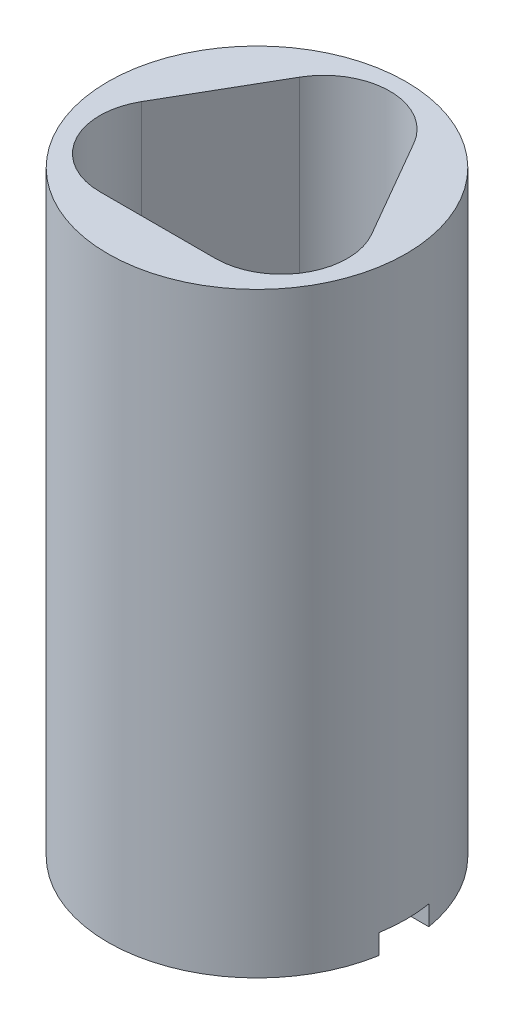
ISO-10303-21;
HEADER;
FILE_DESCRIPTION(('STEP AP214'),'2;1');
FILE_NAME('part.step','',(''),(''),'','','');
FILE_SCHEMA(('AUTOMOTIVE_DESIGN { 1 0 10303 214 1 1 1 1 }'));
ENDSEC;
DATA;
#1=APPLICATION_CONTEXT('core data for automotive mechanical design processes');
#2=APPLICATION_PROTOCOL_DEFINITION('international standard','automotive_design',2000,#1);
#3=PRODUCT_CONTEXT('',#1,'mechanical');
#4=PRODUCT('Part','Part','',(#3));
#5=PRODUCT_RELATED_PRODUCT_CATEGORY('part','',(#4));
#6=PRODUCT_DEFINITION_FORMATION('','',#4);
#7=PRODUCT_DEFINITION_CONTEXT('part definition',#1,'design');
#8=PRODUCT_DEFINITION('design','',#6,#7);
#9=PRODUCT_DEFINITION_SHAPE('','',#8);
#10=(LENGTH_UNIT() NAMED_UNIT(*) SI_UNIT(.MILLI.,.METRE.));
#11=(NAMED_UNIT(*) PLANE_ANGLE_UNIT() SI_UNIT($,.RADIAN.));
#12=(NAMED_UNIT(*) SI_UNIT($,.STERADIAN.) SOLID_ANGLE_UNIT());
#13=UNCERTAINTY_MEASURE_WITH_UNIT(LENGTH_MEASURE(1.E-05),#10,'distance_accuracy_value','');
#14=(GEOMETRIC_REPRESENTATION_CONTEXT(3) GLOBAL_UNCERTAINTY_ASSIGNED_CONTEXT((#13)) GLOBAL_UNIT_ASSIGNED_CONTEXT((#10,
#11,#12)) REPRESENTATION_CONTEXT('',''));
#15=CARTESIAN_POINT('',(0.,0.,0.));
#16=DIRECTION('',(0.,0.,1.));
#17=DIRECTION('',(1.,0.,0.));
#18=AXIS2_PLACEMENT_3D('',#15,#16,#17);
#19=CARTESIAN_POINT('',(0.,0.,0.));
#20=DIRECTION('',(0.,1.,0.));
#21=DIRECTION('',(0.,0.,1.));
#22=AXIS2_PLACEMENT_3D('',#19,#20,#21);
#23=PLANE('',#22);
#24=CARTESIAN_POINT('',(0.,0.,0.));
#25=DIRECTION('',(0.,1.,0.));
#26=DIRECTION('',(0.,0.,1.));
#27=AXIS2_PLACEMENT_3D('',#24,#25,#26);
#28=CIRCLE('',#27,4.7625);
#29=CARTESIAN_POINT('',(-4.69588832783532,0.,0.79375));
#30=VERTEX_POINT('',#29);
#31=CARTESIAN_POINT('',(4.69588832783532,0.,0.79375));
#32=VERTEX_POINT('',#31);
#33=EDGE_CURVE('E249',#30,#32,#28,.T.);
#34=ORIENTED_EDGE('',*,*,#33,.F.);
#35=DIRECTION('',(-1.,0.,0.));
#36=VECTOR('',#35,1.);
#37=CARTESIAN_POINT('',(4.7625,0.,0.79375));
#38=LINE('',#37,#36);
#39=CARTESIAN_POINT('',(-3.40110528909353,0.,0.79375));
#40=VERTEX_POINT('',#39);
#41=EDGE_CURVE('E150',#40,#30,#38,.T.);
#42=ORIENTED_EDGE('',*,*,#41,.F.);
#43=CARTESIAN_POINT('',(0.,0.,0.));
#44=DIRECTION('',(0.,-1.,0.));
#45=DIRECTION('',(0.,0.,-1.));
#46=AXIS2_PLACEMENT_3D('',#43,#44,#45);
#47=CIRCLE('',#46,3.4925);
#48=CARTESIAN_POINT('',(3.40110528909353,0.,0.79375));
#49=VERTEX_POINT('',#48);
#50=EDGE_CURVE('E243',#49,#40,#47,.T.);
#51=ORIENTED_EDGE('',*,*,#50,.F.);
#52=EDGE_CURVE('E306',#32,#49,#38,.T.);
#53=ORIENTED_EDGE('',*,*,#52,.F.);
#54=EDGE_LOOP('',(#34,#42,#51,#53));
#55=FACE_BOUND('',#54,.T.);
#56=ADVANCED_FACE('F41',(#55),#23,.F.);
#57=CARTESIAN_POINT('',(0.,0.635,0.));
#58=DIRECTION('',(0.,-1.,0.));
#59=DIRECTION('',(0.,0.,-1.));
#60=AXIS2_PLACEMENT_3D('',#57,#58,#59);
#61=CYLINDRICAL_SURFACE('',#60,3.4925);
#62=ORIENTED_EDGE('',*,*,#50,.T.);
#63=DIRECTION('',(0.,-1.,0.));
#64=VECTOR('',#63,1.);
#65=CARTESIAN_POINT('',(-3.40110528909353,0.635,0.79375));
#66=LINE('',#65,#64);
#67=CARTESIAN_POINT('',(-3.40110528909353,0.635,0.79375));
#68=VERTEX_POINT('',#67);
#69=EDGE_CURVE('E186',#40,#68,#66,.F.);
#70=ORIENTED_EDGE('',*,*,#69,.T.);
#71=CARTESIAN_POINT('',(0.,0.635,0.));
#72=DIRECTION('',(0.,-1.,0.));
#73=DIRECTION('',(0.,0.,-1.));
#74=AXIS2_PLACEMENT_3D('',#71,#72,#73);
#75=CIRCLE('',#74,3.4925);
#76=CARTESIAN_POINT('',(3.40110528909353,0.635,0.79375));
#77=VERTEX_POINT('',#76);
#78=EDGE_CURVE('E161',#77,#68,#75,.T.);
#79=ORIENTED_EDGE('',*,*,#78,.F.);
#80=DIRECTION('',(0.,-1.,0.));
#81=VECTOR('',#80,1.);
#82=CARTESIAN_POINT('',(3.40110528909353,0.635,0.79375));
#83=LINE('',#82,#81);
#84=EDGE_CURVE('E183',#77,#49,#83,.T.);
#85=ORIENTED_EDGE('',*,*,#84,.T.);
#86=EDGE_LOOP('',(#62,#70,#79,#85));
#87=FACE_BOUND('',#86,.T.);
#88=ADVANCED_FACE('F275',(#87),#61,.F.);
#89=CARTESIAN_POINT('',(0.,19.05,0.));
#90=DIRECTION('',(0.,-1.,0.));
#91=DIRECTION('',(0.,0.,-1.));
#92=AXIS2_PLACEMENT_3D('',#89,#90,#91);
#93=CYLINDRICAL_SURFACE('',#92,4.7625);
#94=ORIENTED_EDGE('',*,*,#33,.T.);
#95=DIRECTION('',(0.,-1.,0.));
#96=VECTOR('',#95,1.);
#97=CARTESIAN_POINT('',(4.69588832783532,19.05,0.79375));
#98=LINE('',#97,#96);
#99=CARTESIAN_POINT('',(4.69588832783532,0.635,0.79375));
#100=VERTEX_POINT('',#99);
#101=EDGE_CURVE('E156',#32,#100,#98,.F.);
#102=ORIENTED_EDGE('',*,*,#101,.T.);
#103=CARTESIAN_POINT('',(0.,0.635,0.));
#104=DIRECTION('',(0.,-1.,0.));
#105=DIRECTION('',(0.,0.,-1.));
#106=AXIS2_PLACEMENT_3D('',#103,#104,#105);
#107=CIRCLE('',#106,4.7625);
#108=CARTESIAN_POINT('',(4.69588832783532,0.635,-0.79375));
#109=VERTEX_POINT('',#108);
#110=EDGE_CURVE('E167',#109,#100,#107,.T.);
#111=ORIENTED_EDGE('',*,*,#110,.F.);
#112=DIRECTION('',(0.,-1.,0.));
#113=VECTOR('',#112,1.);
#114=CARTESIAN_POINT('',(4.69588832783532,19.05,-0.79375));
#115=LINE('',#114,#113);
#116=CARTESIAN_POINT('',(4.69588832783532,0.,-0.79375));
#117=VERTEX_POINT('',#116);
#118=EDGE_CURVE('E180',#109,#117,#115,.T.);
#119=ORIENTED_EDGE('',*,*,#118,.T.);
#120=CARTESIAN_POINT('',(-4.69588832783532,0.,-0.79375));
#121=VERTEX_POINT('',#120);
#122=EDGE_CURVE('E50',#117,#121,#28,.T.);
#123=ORIENTED_EDGE('',*,*,#122,.T.);
#124=DIRECTION('',(0.,-1.,0.));
#125=VECTOR('',#124,1.);
#126=CARTESIAN_POINT('',(-4.69588832783532,19.05,-0.79375));
#127=LINE('',#126,#125);
#128=CARTESIAN_POINT('',(-4.69588832783532,0.635,-0.79375));
#129=VERTEX_POINT('',#128);
#130=EDGE_CURVE('E166',#121,#129,#127,.F.);
#131=ORIENTED_EDGE('',*,*,#130,.T.);
#132=CARTESIAN_POINT('',(-4.69588832783532,0.635,0.79375));
#133=VERTEX_POINT('',#132);
#134=EDGE_CURVE('E159',#133,#129,#107,.T.);
#135=ORIENTED_EDGE('',*,*,#134,.F.);
#136=DIRECTION('',(0.,-1.,0.));
#137=VECTOR('',#136,1.);
#138=CARTESIAN_POINT('',(-4.69588832783532,19.05,0.79375));
#139=LINE('',#138,#137);
#140=EDGE_CURVE('E144',#133,#30,#139,.T.);
#141=ORIENTED_EDGE('',*,*,#140,.T.);
#142=EDGE_LOOP('',(#94,#102,#111,#119,#123,#131,#135,#141));
#143=FACE_BOUND('',#142,.T.);
#144=CARTESIAN_POINT('',(0.,19.05,0.));
#145=DIRECTION('',(0.,1.,0.));
#146=DIRECTION('',(0.,0.,1.));
#147=AXIS2_PLACEMENT_3D('',#144,#145,#146);
#148=CIRCLE('',#147,4.7625);
#149=CARTESIAN_POINT('',(0.,19.05,4.7625));
#150=VERTEX_POINT('',#149);
#151=EDGE_CURVE('E11',#150,#150,#148,.T.);
#152=ORIENTED_EDGE('',*,*,#151,.F.);
#153=EDGE_LOOP('',(#152));
#154=FACE_BOUND('',#153,.T.);
#155=ADVANCED_FACE('F43',(#143,#154),#93,.T.);
#156=CARTESIAN_POINT('',(0.,19.05,0.));
#157=DIRECTION('',(0.,1.,0.));
#158=DIRECTION('',(0.,0.,1.));
#159=AXIS2_PLACEMENT_3D('',#156,#157,#158);
#160=PLANE('',#159);
#161=CARTESIAN_POINT('',(1.84775180151448,19.05,1.0668));
#162=DIRECTION('',(0.,1.,0.));
#163=DIRECTION('',(0.,0.,1.));
#164=AXIS2_PLACEMENT_3D('',#161,#162,#163);
#165=CIRCLE('',#164,2.1082);
#166=CARTESIAN_POINT('',(1.84775180151445,19.05,3.175));
#167=VERTEX_POINT('',#166);
#168=CARTESIAN_POINT('',(3.67350655777282,19.05,0.0126999999999734));
#169=VERTEX_POINT('',#168);
#170=EDGE_CURVE('E212',#167,#169,#165,.T.);
#171=ORIENTED_EDGE('',*,*,#170,.F.);
#172=DIRECTION('',(1.,0.,0.));
#173=VECTOR('',#172,1.);
#174=CARTESIAN_POINT('',(-1.84775180151445,19.05,3.175));
#175=LINE('',#174,#173);
#176=CARTESIAN_POINT('',(-1.84775180151445,19.05,3.175));
#177=VERTEX_POINT('',#176);
#178=EDGE_CURVE('E196',#177,#167,#175,.T.);
#179=ORIENTED_EDGE('',*,*,#178,.F.);
#180=CARTESIAN_POINT('',(-1.84775180151448,19.05,1.0668));
#181=DIRECTION('',(0.,1.,0.));
#182=DIRECTION('',(0.,0.,1.));
#183=AXIS2_PLACEMENT_3D('',#180,#181,#182);
#184=CIRCLE('',#183,2.1082);
#185=CARTESIAN_POINT('',(-3.67350655777282,19.05,0.0126999999999755));
#186=VERTEX_POINT('',#185);
#187=EDGE_CURVE('E223',#186,#177,#184,.T.);
#188=ORIENTED_EDGE('',*,*,#187,.F.);
#189=DIRECTION('',(-0.5,0.,0.866025403784439));
#190=VECTOR('',#189,1.);
#191=CARTESIAN_POINT('',(-1.82575475625837,19.05,-3.18769999999997));
#192=LINE('',#191,#190);
#193=CARTESIAN_POINT('',(-1.82575475625837,19.05,-3.18769999999997));
#194=VERTEX_POINT('',#193);
#195=EDGE_CURVE('E220',#194,#186,#192,.T.);
#196=ORIENTED_EDGE('',*,*,#195,.F.);
#197=CARTESIAN_POINT('',(0.,19.05,-2.1336));
#198=DIRECTION('',(0.,1.,0.));
#199=DIRECTION('',(0.,0.,-1.));
#200=AXIS2_PLACEMENT_3D('',#197,#198,#199);
#201=CIRCLE('',#200,2.1082);
#202=CARTESIAN_POINT('',(1.82575475625837,19.05,-3.18769999999997));
#203=VERTEX_POINT('',#202);
#204=EDGE_CURVE('E217',#203,#194,#201,.T.);
#205=ORIENTED_EDGE('',*,*,#204,.F.);
#206=DIRECTION('',(-0.5,0.,-0.866025403784438));
#207=VECTOR('',#206,1.);
#208=CARTESIAN_POINT('',(3.67350655777282,19.05,0.0126999999999736));
#209=LINE('',#208,#207);
#210=EDGE_CURVE('E214',#169,#203,#209,.T.);
#211=ORIENTED_EDGE('',*,*,#210,.F.);
#212=EDGE_LOOP('',(#171,#179,#188,#196,#205,#211));
#213=FACE_BOUND('',#212,.T.);
#214=ORIENTED_EDGE('',*,*,#151,.T.);
#215=EDGE_LOOP('',(#214));
#216=FACE_BOUND('',#215,.T.);
#217=ADVANCED_FACE('F285',(#213,#216),#160,.T.);
#218=ORIENTED_EDGE('',*,*,#122,.F.);
#219=DIRECTION('',(1.,0.,0.));
#220=VECTOR('',#219,1.);
#221=CARTESIAN_POINT('',(4.7625,0.,-0.79375));
#222=LINE('',#221,#220);
#223=CARTESIAN_POINT('',(3.40110528909353,0.,-0.79375));
#224=VERTEX_POINT('',#223);
#225=EDGE_CURVE('E297',#224,#117,#222,.T.);
#226=ORIENTED_EDGE('',*,*,#225,.F.);
#227=CARTESIAN_POINT('',(-3.40110528909353,0.,-0.79375));
#228=VERTEX_POINT('',#227);
#229=EDGE_CURVE('E244',#228,#224,#47,.T.);
#230=ORIENTED_EDGE('',*,*,#229,.F.);
#231=EDGE_CURVE('E298',#121,#228,#222,.T.);
#232=ORIENTED_EDGE('',*,*,#231,.F.);
#233=EDGE_LOOP('',(#218,#226,#230,#232));
#234=FACE_BOUND('',#233,.T.);
#235=ADVANCED_FACE('F277',(#234),#23,.F.);
#236=ORIENTED_EDGE('',*,*,#229,.T.);
#237=DIRECTION('',(0.,-1.,0.));
#238=VECTOR('',#237,1.);
#239=CARTESIAN_POINT('',(3.40110528909353,0.635,-0.79375));
#240=LINE('',#239,#238);
#241=CARTESIAN_POINT('',(3.40110528909353,0.635,-0.79375));
#242=VERTEX_POINT('',#241);
#243=EDGE_CURVE('E176',#224,#242,#240,.F.);
#244=ORIENTED_EDGE('',*,*,#243,.T.);
#245=CARTESIAN_POINT('',(-3.40110528909353,0.635,-0.79375));
#246=VERTEX_POINT('',#245);
#247=EDGE_CURVE('E241',#246,#242,#75,.T.);
#248=ORIENTED_EDGE('',*,*,#247,.F.);
#249=DIRECTION('',(0.,-1.,0.));
#250=VECTOR('',#249,1.);
#251=CARTESIAN_POINT('',(-3.40110528909353,0.635,-0.79375));
#252=LINE('',#251,#250);
#253=EDGE_CURVE('E170',#246,#228,#252,.T.);
#254=ORIENTED_EDGE('',*,*,#253,.T.);
#255=EDGE_LOOP('',(#236,#244,#248,#254));
#256=FACE_BOUND('',#255,.T.);
#257=ADVANCED_FACE('F283',(#256),#61,.F.);
#258=CARTESIAN_POINT('',(0.,0.635,0.));
#259=DIRECTION('',(0.,-1.,0.));
#260=DIRECTION('',(0.,0.,-1.));
#261=AXIS2_PLACEMENT_3D('',#258,#259,#260);
#262=PLANE('',#261);
#263=CARTESIAN_POINT('',(0.,0.635,0.));
#264=DIRECTION('',(0.,-1.,0.));
#265=DIRECTION('',(0.,0.,-1.));
#266=AXIS2_PLACEMENT_3D('',#263,#264,#265);
#267=CIRCLE('',#266,1.78562);
#268=CARTESIAN_POINT('',(0.,0.635,-1.78562));
#269=VERTEX_POINT('',#268);
#270=EDGE_CURVE('E155',#269,#269,#267,.T.);
#271=ORIENTED_EDGE('',*,*,#270,.F.);
#272=EDGE_LOOP('',(#271));
#273=FACE_BOUND('',#272,.T.);
#274=ORIENTED_EDGE('',*,*,#247,.T.);
#275=DIRECTION('',(-1.,0.,0.));
#276=VECTOR('',#275,1.);
#277=CARTESIAN_POINT('',(4.7625,0.635,-0.79375));
#278=LINE('',#277,#276);
#279=EDGE_CURVE('E168',#109,#242,#278,.T.);
#280=ORIENTED_EDGE('',*,*,#279,.F.);
#281=ORIENTED_EDGE('',*,*,#110,.T.);
#282=DIRECTION('',(1.,0.,0.));
#283=VECTOR('',#282,1.);
#284=CARTESIAN_POINT('',(4.7625,0.635,0.79375));
#285=LINE('',#284,#283);
#286=EDGE_CURVE('E65',#77,#100,#285,.T.);
#287=ORIENTED_EDGE('',*,*,#286,.F.);
#288=ORIENTED_EDGE('',*,*,#78,.T.);
#289=EDGE_CURVE('E147',#133,#68,#285,.T.);
#290=ORIENTED_EDGE('',*,*,#289,.F.);
#291=ORIENTED_EDGE('',*,*,#134,.T.);
#292=EDGE_CURVE('E58',#246,#129,#278,.T.);
#293=ORIENTED_EDGE('',*,*,#292,.F.);
#294=EDGE_LOOP('',(#274,#280,#281,#287,#288,#290,#291,#293));
#295=FACE_BOUND('',#294,.T.);
#296=ADVANCED_FACE('F158',(#273,#295),#262,.T.);
#297=CARTESIAN_POINT('',(1.84775180151448,12.7,1.0668));
#298=DIRECTION('',(0.,1.,0.));
#299=DIRECTION('',(0.,0.,1.));
#300=AXIS2_PLACEMENT_3D('',#297,#298,#299);
#301=PLANE('',#300);
#302=CARTESIAN_POINT('',(1.84775180151448,12.7,1.0668));
#303=DIRECTION('',(0.,1.,0.));
#304=DIRECTION('',(0.,0.,1.));
#305=AXIS2_PLACEMENT_3D('',#302,#303,#304);
#306=CIRCLE('',#305,2.1082);
#307=CARTESIAN_POINT('',(1.84775180151445,12.7,3.175));
#308=VERTEX_POINT('',#307);
#309=CARTESIAN_POINT('',(3.67350655777282,12.7,0.0126999999999736));
#310=VERTEX_POINT('',#309);
#311=EDGE_CURVE('E192',#308,#310,#306,.T.);
#312=ORIENTED_EDGE('',*,*,#311,.T.);
#313=DIRECTION('',(-0.5,0.,-0.866025403784438));
#314=VECTOR('',#313,1.);
#315=CARTESIAN_POINT('',(3.67350655777282,12.7,0.0126999999999736));
#316=LINE('',#315,#314);
#317=CARTESIAN_POINT('',(1.82575475625837,12.7,-3.18769999999997));
#318=VERTEX_POINT('',#317);
#319=EDGE_CURVE('E195',#310,#318,#316,.T.);
#320=ORIENTED_EDGE('',*,*,#319,.T.);
#321=CARTESIAN_POINT('',(0.,12.7,-2.1336));
#322=DIRECTION('',(0.,1.,0.));
#323=DIRECTION('',(0.,0.,-1.));
#324=AXIS2_PLACEMENT_3D('',#321,#322,#323);
#325=CIRCLE('',#324,2.1082);
#326=CARTESIAN_POINT('',(-1.82575475625837,12.7,-3.18769999999997));
#327=VERTEX_POINT('',#326);
#328=EDGE_CURVE('E199',#318,#327,#325,.T.);
#329=ORIENTED_EDGE('',*,*,#328,.T.);
#330=DIRECTION('',(-0.5,0.,0.866025403784439));
#331=VECTOR('',#330,1.);
#332=CARTESIAN_POINT('',(-1.82575475625837,12.7,-3.18769999999997));
#333=LINE('',#332,#331);
#334=CARTESIAN_POINT('',(-3.67350655777282,12.7,0.0126999999999755));
#335=VERTEX_POINT('',#334);
#336=EDGE_CURVE('E202',#327,#335,#333,.T.);
#337=ORIENTED_EDGE('',*,*,#336,.T.);
#338=CARTESIAN_POINT('',(-1.84775180151448,12.7,1.0668));
#339=DIRECTION('',(0.,1.,0.));
#340=DIRECTION('',(0.,0.,1.));
#341=AXIS2_PLACEMENT_3D('',#338,#339,#340);
#342=CIRCLE('',#341,2.1082);
#343=CARTESIAN_POINT('',(-1.84775180151445,12.7,3.175));
#344=VERTEX_POINT('',#343);
#345=EDGE_CURVE('E205',#335,#344,#342,.T.);
#346=ORIENTED_EDGE('',*,*,#345,.T.);
#347=DIRECTION('',(1.,0.,0.));
#348=VECTOR('',#347,1.);
#349=CARTESIAN_POINT('',(-1.84775180151445,12.7,3.175));
#350=LINE('',#349,#348);
#351=EDGE_CURVE('E208',#344,#308,#350,.T.);
#352=ORIENTED_EDGE('',*,*,#351,.T.);
#353=EDGE_LOOP('',(#312,#320,#329,#337,#346,#352));
#354=FACE_BOUND('',#353,.T.);
#355=CARTESIAN_POINT('',(0.,12.7,0.));
#356=DIRECTION('',(0.,1.,0.));
#357=DIRECTION('',(0.,0.,1.));
#358=AXIS2_PLACEMENT_3D('',#355,#356,#357);
#359=CIRCLE('',#358,3.0607);
#360=CARTESIAN_POINT('',(0.,12.7,3.0607));
#361=VERTEX_POINT('',#360);
#362=EDGE_CURVE('E230',#361,#361,#359,.F.);
#363=ORIENTED_EDGE('',*,*,#362,.T.);
#364=EDGE_LOOP('',(#363));
#365=FACE_BOUND('',#364,.T.);
#366=ADVANCED_FACE('F254',(#354,#365),#301,.T.);
#367=CARTESIAN_POINT('',(1.84775180151448,12.7,1.0668));
#368=DIRECTION('',(0.,1.,0.));
#369=DIRECTION('',(0.,0.,1.));
#370=AXIS2_PLACEMENT_3D('',#367,#368,#369);
#371=CYLINDRICAL_SURFACE('',#370,2.1082);
#372=ORIENTED_EDGE('',*,*,#170,.T.);
#373=DIRECTION('',(0.,1.,0.));
#374=VECTOR('',#373,1.);
#375=CARTESIAN_POINT('',(3.67350655777282,12.7,0.0126999999999736));
#376=LINE('',#375,#374);
#377=EDGE_CURVE('E211',#310,#169,#376,.T.);
#378=ORIENTED_EDGE('',*,*,#377,.F.);
#379=ORIENTED_EDGE('',*,*,#311,.F.);
#380=DIRECTION('',(0.,1.,0.));
#381=VECTOR('',#380,1.);
#382=CARTESIAN_POINT('',(1.84775180151445,12.7,3.175));
#383=LINE('',#382,#381);
#384=EDGE_CURVE('E228',#308,#167,#383,.T.);
#385=ORIENTED_EDGE('',*,*,#384,.T.);
#386=EDGE_LOOP('',(#372,#378,#379,#385));
#387=FACE_BOUND('',#386,.T.);
#388=ADVANCED_FACE('F322',(#387),#371,.F.);
#389=CARTESIAN_POINT('',(-1.84775180151445,12.7,3.175));
#390=DIRECTION('',(0.,0.,1.));
#391=DIRECTION('',(1.,0.,0.));
#392=AXIS2_PLACEMENT_3D('',#389,#390,#391);
#393=PLANE('',#392);
#394=ORIENTED_EDGE('',*,*,#178,.T.);
#395=ORIENTED_EDGE('',*,*,#384,.F.);
#396=ORIENTED_EDGE('',*,*,#351,.F.);
#397=DIRECTION('',(0.,1.,0.));
#398=VECTOR('',#397,1.);
#399=CARTESIAN_POINT('',(-1.84775180151445,12.7,3.175));
#400=LINE('',#399,#398);
#401=EDGE_CURVE('E231',#344,#177,#400,.T.);
#402=ORIENTED_EDGE('',*,*,#401,.T.);
#403=EDGE_LOOP('',(#394,#395,#396,#402));
#404=FACE_BOUND('',#403,.T.);
#405=ADVANCED_FACE('F324',(#404),#393,.F.);
#406=CARTESIAN_POINT('',(-1.84775180151448,12.7,1.0668));
#407=DIRECTION('',(0.,1.,0.));
#408=DIRECTION('',(0.,0.,1.));
#409=AXIS2_PLACEMENT_3D('',#406,#407,#408);
#410=CYLINDRICAL_SURFACE('',#409,2.1082);
#411=ORIENTED_EDGE('',*,*,#187,.T.);
#412=ORIENTED_EDGE('',*,*,#401,.F.);
#413=ORIENTED_EDGE('',*,*,#345,.F.);
#414=DIRECTION('',(0.,1.,0.));
#415=VECTOR('',#414,1.);
#416=CARTESIAN_POINT('',(-3.67350655777282,12.7,0.0126999999999755));
#417=LINE('',#416,#415);
#418=EDGE_CURVE('E233',#335,#186,#417,.T.);
#419=ORIENTED_EDGE('',*,*,#418,.T.);
#420=EDGE_LOOP('',(#411,#412,#413,#419));
#421=FACE_BOUND('',#420,.T.);
#422=ADVANCED_FACE('F327',(#421),#410,.F.);
#423=CARTESIAN_POINT('',(-1.82575475625837,12.7,-3.18769999999997));
#424=DIRECTION('',(-0.866025403784439,0.,-0.5));
#425=DIRECTION('',(-0.5,0.,0.866025403784439));
#426=AXIS2_PLACEMENT_3D('',#423,#424,#425);
#427=PLANE('',#426);
#428=ORIENTED_EDGE('',*,*,#195,.T.);
#429=ORIENTED_EDGE('',*,*,#418,.F.);
#430=ORIENTED_EDGE('',*,*,#336,.F.);
#431=DIRECTION('',(0.,1.,0.));
#432=VECTOR('',#431,1.);
#433=CARTESIAN_POINT('',(-1.82575475625837,12.7,-3.18769999999997));
#434=LINE('',#433,#432);
#435=EDGE_CURVE('E235',#327,#194,#434,.T.);
#436=ORIENTED_EDGE('',*,*,#435,.T.);
#437=EDGE_LOOP('',(#428,#429,#430,#436));
#438=FACE_BOUND('',#437,.T.);
#439=ADVANCED_FACE('F331',(#438),#427,.F.);
#440=CARTESIAN_POINT('',(0.,12.7,-2.1336));
#441=DIRECTION('',(0.,1.,0.));
#442=DIRECTION('',(0.,0.,1.));
#443=AXIS2_PLACEMENT_3D('',#440,#441,#442);
#444=CYLINDRICAL_SURFACE('',#443,2.1082);
#445=ORIENTED_EDGE('',*,*,#204,.T.);
#446=ORIENTED_EDGE('',*,*,#435,.F.);
#447=ORIENTED_EDGE('',*,*,#328,.F.);
#448=DIRECTION('',(0.,1.,0.));
#449=VECTOR('',#448,1.);
#450=CARTESIAN_POINT('',(1.82575475625837,12.7,-3.18769999999997));
#451=LINE('',#450,#449);
#452=EDGE_CURVE('E237',#318,#203,#451,.T.);
#453=ORIENTED_EDGE('',*,*,#452,.T.);
#454=EDGE_LOOP('',(#445,#446,#447,#453));
#455=FACE_BOUND('',#454,.T.);
#456=ADVANCED_FACE('F335',(#455),#444,.F.);
#457=CARTESIAN_POINT('',(3.67350655777282,12.7,0.0126999999999736));
#458=DIRECTION('',(0.866025403784438,0.,-0.5));
#459=DIRECTION('',(-0.500000000000001,0.,-0.866025403784438));
#460=AXIS2_PLACEMENT_3D('',#457,#458,#459);
#461=PLANE('',#460);
#462=ORIENTED_EDGE('',*,*,#210,.T.);
#463=ORIENTED_EDGE('',*,*,#452,.F.);
#464=ORIENTED_EDGE('',*,*,#319,.F.);
#465=ORIENTED_EDGE('',*,*,#377,.T.);
#466=EDGE_LOOP('',(#462,#463,#464,#465));
#467=FACE_BOUND('',#466,.T.);
#468=ADVANCED_FACE('F269',(#467),#461,.F.);
#469=CARTESIAN_POINT('',(0.,8.636,0.));
#470=DIRECTION('',(0.,1.,0.));
#471=DIRECTION('',(0.,0.,1.));
#472=AXIS2_PLACEMENT_3D('',#469,#470,#471);
#473=PLANE('',#472);
#474=CARTESIAN_POINT('',(0.,8.636,0.));
#475=DIRECTION('',(0.,1.,0.));
#476=DIRECTION('',(0.,0.,1.));
#477=AXIS2_PLACEMENT_3D('',#474,#475,#476);
#478=CIRCLE('',#477,1.78562);
#479=CARTESIAN_POINT('',(0.,8.636,1.78562));
#480=VERTEX_POINT('',#479);
#481=EDGE_CURVE('E45',#480,#480,#478,.T.);
#482=ORIENTED_EDGE('',*,*,#481,.F.);
#483=EDGE_LOOP('',(#482));
#484=FACE_BOUND('',#483,.T.);
#485=CARTESIAN_POINT('',(0.,8.636,0.));
#486=DIRECTION('',(0.,1.,0.));
#487=DIRECTION('',(0.,0.,1.));
#488=AXIS2_PLACEMENT_3D('',#485,#486,#487);
#489=CIRCLE('',#488,3.0607);
#490=CARTESIAN_POINT('',(0.,8.636,3.0607));
#491=VERTEX_POINT('',#490);
#492=EDGE_CURVE('E247',#491,#491,#489,.T.);
#493=ORIENTED_EDGE('',*,*,#492,.T.);
#494=EDGE_LOOP('',(#493));
#495=FACE_BOUND('',#494,.T.);
#496=ADVANCED_FACE('F259',(#484,#495),#473,.T.);
#497=CARTESIAN_POINT('',(0.,8.636,0.));
#498=DIRECTION('',(0.,1.,0.));
#499=DIRECTION('',(0.,0.,1.));
#500=AXIS2_PLACEMENT_3D('',#497,#498,#499);
#501=CYLINDRICAL_SURFACE('',#500,3.0607);
#502=ORIENTED_EDGE('',*,*,#492,.F.);
#503=EDGE_LOOP('',(#502));
#504=FACE_BOUND('',#503,.T.);
#505=ORIENTED_EDGE('',*,*,#362,.F.);
#506=EDGE_LOOP('',(#505));
#507=FACE_BOUND('',#506,.T.);
#508=ADVANCED_FACE('F256',(#504,#507),#501,.F.);
#509=CARTESIAN_POINT('',(0.,0.635,0.));
#510=DIRECTION('',(0.,-1.,0.));
#511=DIRECTION('',(0.,0.,-1.));
#512=AXIS2_PLACEMENT_3D('',#509,#510,#511);
#513=CYLINDRICAL_SURFACE('',#512,1.78562);
#514=ORIENTED_EDGE('',*,*,#481,.T.);
#515=EDGE_LOOP('',(#514));
#516=FACE_BOUND('',#515,.T.);
#517=ORIENTED_EDGE('',*,*,#270,.T.);
#518=EDGE_LOOP('',(#517));
#519=FACE_BOUND('',#518,.T.);
#520=ADVANCED_FACE('F258',(#516,#519),#513,.F.);
#521=CARTESIAN_POINT('',(4.7625,10.2913855168484,-0.79375));
#522=DIRECTION('',(0.,0.,-1.));
#523=DIRECTION('',(-1.,0.,0.));
#524=AXIS2_PLACEMENT_3D('',#521,#522,#523);
#525=PLANE('',#524);
#526=ORIENTED_EDGE('',*,*,#279,.T.);
#527=ORIENTED_EDGE('',*,*,#243,.F.);
#528=ORIENTED_EDGE('',*,*,#225,.T.);
#529=ORIENTED_EDGE('',*,*,#118,.F.);
#530=EDGE_LOOP('',(#526,#527,#528,#529));
#531=FACE_BOUND('',#530,.T.);
#532=ADVANCED_FACE('F266',(#531),#525,.F.);
#533=CARTESIAN_POINT('',(4.7625,10.2913855168484,0.79375));
#534=DIRECTION('',(0.,0.,1.));
#535=DIRECTION('',(1.,0.,0.));
#536=AXIS2_PLACEMENT_3D('',#533,#534,#535);
#537=PLANE('',#536);
#538=ORIENTED_EDGE('',*,*,#52,.T.);
#539=ORIENTED_EDGE('',*,*,#84,.F.);
#540=ORIENTED_EDGE('',*,*,#286,.T.);
#541=ORIENTED_EDGE('',*,*,#101,.F.);
#542=EDGE_LOOP('',(#538,#539,#540,#541));
#543=FACE_BOUND('',#542,.T.);
#544=ADVANCED_FACE('F309',(#543),#537,.F.);
#545=ORIENTED_EDGE('',*,*,#289,.T.);
#546=ORIENTED_EDGE('',*,*,#69,.F.);
#547=ORIENTED_EDGE('',*,*,#41,.T.);
#548=ORIENTED_EDGE('',*,*,#140,.F.);
#549=EDGE_LOOP('',(#545,#546,#547,#548));
#550=FACE_BOUND('',#549,.T.);
#551=ADVANCED_FACE('F146',(#550),#537,.F.);
#552=ORIENTED_EDGE('',*,*,#231,.T.);
#553=ORIENTED_EDGE('',*,*,#253,.F.);
#554=ORIENTED_EDGE('',*,*,#292,.T.);
#555=ORIENTED_EDGE('',*,*,#130,.F.);
#556=EDGE_LOOP('',(#552,#553,#554,#555));
#557=FACE_BOUND('',#556,.T.);
#558=ADVANCED_FACE('F304',(#557),#525,.F.);
#559=CLOSED_SHELL('',(#56,#88,#155,#217,#235,#257,#296,#366,#388,#405,#422,#439,#456,#468,#496,
#508,#520,#532,#544,#551,#558));
#560=MANIFOLD_SOLID_BREP('B2',#559);
#561=ADVANCED_BREP_SHAPE_REPRESENTATION('',(#18,#560),#14);
#562=SHAPE_DEFINITION_REPRESENTATION(#9,#561);
ENDSEC;
END-ISO-10303-21;
